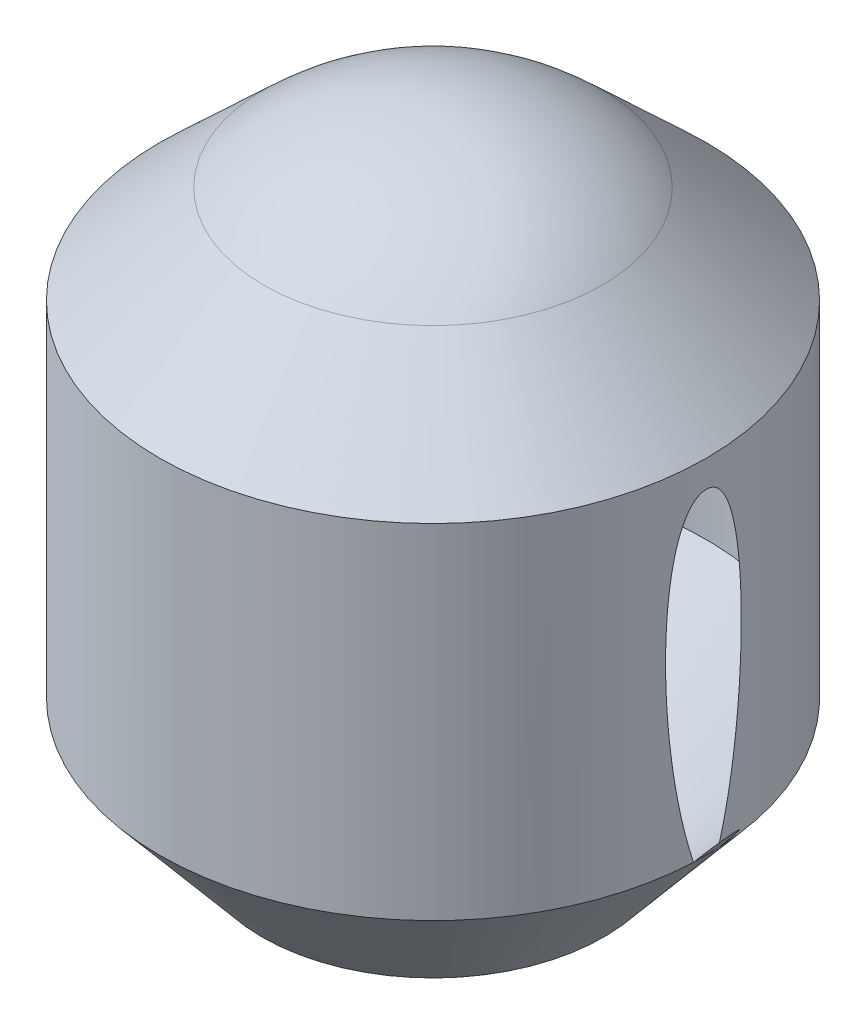
ISO-10303-21;
HEADER;
FILE_DESCRIPTION(('STEP AP214'),'2;1');
FILE_NAME('part.step','',(''),(''),'','','');
FILE_SCHEMA(('AUTOMOTIVE_DESIGN { 1 0 10303 214 1 1 1 1 }'));
ENDSEC;
DATA;
#1=APPLICATION_CONTEXT('core data for automotive mechanical design processes');
#2=APPLICATION_PROTOCOL_DEFINITION('international standard','automotive_design',2000,#1);
#3=PRODUCT_CONTEXT('',#1,'mechanical');
#4=PRODUCT('Part','Part','',(#3));
#5=PRODUCT_RELATED_PRODUCT_CATEGORY('part','',(#4));
#6=PRODUCT_DEFINITION_FORMATION('','',#4);
#7=PRODUCT_DEFINITION_CONTEXT('part definition',#1,'design');
#8=PRODUCT_DEFINITION('design','',#6,#7);
#9=PRODUCT_DEFINITION_SHAPE('','',#8);
#10=(LENGTH_UNIT() NAMED_UNIT(*) SI_UNIT(.MILLI.,.METRE.));
#11=(NAMED_UNIT(*) PLANE_ANGLE_UNIT() SI_UNIT($,.RADIAN.));
#12=(NAMED_UNIT(*) SI_UNIT($,.STERADIAN.) SOLID_ANGLE_UNIT());
#13=UNCERTAINTY_MEASURE_WITH_UNIT(LENGTH_MEASURE(1.E-05),#10,'distance_accuracy_value','');
#14=(GEOMETRIC_REPRESENTATION_CONTEXT(3) GLOBAL_UNCERTAINTY_ASSIGNED_CONTEXT((#13)) GLOBAL_UNIT_ASSIGNED_CONTEXT((#10,
#11,#12)) REPRESENTATION_CONTEXT('',''));
#15=CARTESIAN_POINT('',(0.,0.,0.));
#16=DIRECTION('',(0.,0.,1.));
#17=DIRECTION('',(1.,0.,0.));
#18=AXIS2_PLACEMENT_3D('',#15,#16,#17);
#19=CARTESIAN_POINT('',(0.,0.,0.));
#20=DIRECTION('',(0.,1.,0.));
#21=DIRECTION('',(0.,0.,1.));
#22=AXIS2_PLACEMENT_3D('',#19,#20,#21);
#23=CYLINDRICAL_SURFACE('',#22,40.);
#24=CARTESIAN_POINT('',(0.,68.1923714759536,0.));
#25=DIRECTION('',(0.,1.,0.));
#26=DIRECTION('',(0.,0.,1.));
#27=AXIS2_PLACEMENT_3D('',#24,#25,#26);
#28=CIRCLE('',#27,40.);
#29=CARTESIAN_POINT('',(0.,68.1923714759536,40.));
#30=VERTEX_POINT('',#29);
#31=EDGE_CURVE('E150',#30,#30,#28,.T.);
#32=ORIENTED_EDGE('',*,*,#31,.F.);
#33=EDGE_LOOP('',(#32));
#34=FACE_BOUND('',#33,.T.);
#35=CARTESIAN_POINT('',(39.9611398564331,17.8763038889132,-1.76275391776369));
#36=CARTESIAN_POINT('',(39.9590485028743,18.0263892158643,-1.81015966207606));
#37=CARTESIAN_POINT('',(39.9569044252968,18.1766969010565,-1.85685430112768));
#38=CARTESIAN_POINT('',(39.9525211074002,18.4777203207342,-1.94889280478911));
#39=CARTESIAN_POINT('',(39.9502818692163,18.6284360459937,-1.99423669966641));
#40=CARTESIAN_POINT('',(39.9434345761404,19.0812906239706,-2.12839409840408));
#41=CARTESIAN_POINT('',(39.9386989050502,19.3839973541604,-2.21528939992617));
#42=CARTESIAN_POINT('',(39.9289599666741,19.9907157059756,-2.38439171398567));
#43=CARTESIAN_POINT('',(39.9239566938508,20.2947273544834,-2.4665986294352));
#44=CARTESIAN_POINT('',(39.9137456904261,20.9039364060846,-2.62665946344014));
#45=CARTESIAN_POINT('',(39.9085379311249,21.2091339701673,-2.70451276721676));
#46=CARTESIAN_POINT('',(39.8979746236317,21.8205442648095,-2.85611254358982));
#47=CARTESIAN_POINT('',(39.8926190739814,22.1267570053605,-2.92985897563807));
#48=CARTESIAN_POINT('',(39.8727624790475,23.2537486178319,-3.19375435858761));
#49=CARTESIAN_POINT('',(39.8579678566055,24.0773387924444,-3.37198065621902));
#50=CARTESIAN_POINT('',(39.8284955807113,25.729601005784,-3.70386168263656));
#51=CARTESIAN_POINT('',(39.813817955251,26.5582741814088,-3.85751068950451));
#52=CARTESIAN_POINT('',(39.7851956016083,28.2195694336083,-4.14230435668526));
#53=CARTESIAN_POINT('',(39.7712509483228,29.0521919042914,-4.27344672030212));
#54=CARTESIAN_POINT('',(39.7445765560971,30.7213895406754,-4.51479407356579));
#55=CARTESIAN_POINT('',(39.7318481465492,31.55796800588,-4.62497628050368));
#56=CARTESIAN_POINT('',(39.7080356832509,33.2334613142061,-4.8251484334156));
#57=CARTESIAN_POINT('',(39.6969514320749,34.0723758644728,-4.91514080439155));
#58=CARTESIAN_POINT('',(39.6818213389432,35.3321275230994,-5.03534175179843));
#59=CARTESIAN_POINT('',(39.6770274740735,35.752262347261,-5.0729432449608));
#60=CARTESIAN_POINT('',(39.6679775212901,36.5929641788985,-5.14322933997175));
#61=CARTESIAN_POINT('',(39.6637214567729,37.013531204375,-5.17591372791944));
#62=CARTESIAN_POINT('',(39.649234739176,38.5498630563852,-5.2862881746443));
#63=CARTESIAN_POINT('',(39.6407441171493,39.666769183475,-5.34916893712544));
#64=CARTESIAN_POINT('',(39.6315577090053,41.3431640633532,-5.41664825008471));
#65=CARTESIAN_POINT('',(39.629087149183,41.9021440249106,-5.43466779034163));
#66=CARTESIAN_POINT('',(39.6254094833573,43.020327625321,-5.46142157805313));
#67=CARTESIAN_POINT('',(39.6242023489269,43.579531258858,-5.47015603442257));
#68=CARTESIAN_POINT('',(39.6231335969856,44.6975354826311,-5.47789153040553));
#69=CARTESIAN_POINT('',(39.6232708432422,45.2563360140999,-5.47690078947819));
#70=CARTESIAN_POINT('',(39.6249699154677,46.3738129938668,-5.46459529877964));
#71=CARTESIAN_POINT('',(39.6265317077088,46.9324894447896,-5.45328079343536));
#72=CARTESIAN_POINT('',(39.631163729074,48.0494038447402,-5.41951618106935));
#73=CARTESIAN_POINT('',(39.6342336836384,48.6076418550655,-5.39706810089933));
#74=CARTESIAN_POINT('',(39.6419705174818,49.723473150519,-5.33994486648881));
#75=CARTESIAN_POINT('',(39.6466373468622,50.2810664552465,-5.30527009430371));
#76=CARTESIAN_POINT('',(39.65797312173,51.4266481178843,-5.21987908494987));
#77=CARTESIAN_POINT('',(39.664740142785,52.0145770479995,-5.16836839821881));
#78=CARTESIAN_POINT('',(39.6802822241238,53.1887142903217,-5.0476692685949));
#79=CARTESIAN_POINT('',(39.6890575365492,53.7749223771085,-4.97847860584953));
#80=CARTESIAN_POINT('',(39.7038261483287,54.6523248503745,-4.85878265328046));
#81=CARTESIAN_POINT('',(39.7090196795723,54.944622381182,-4.81620661006086));
#82=CARTESIAN_POINT('',(39.7199579474636,55.5282825126726,-4.72515142357244));
#83=CARTESIAN_POINT('',(39.7257026644103,55.8196451463874,-4.67667249127454));
#84=CARTESIAN_POINT('',(39.7377580320454,56.4011060163797,-4.57310664893302));
#85=CARTESIAN_POINT('',(39.7440685286189,56.6912045745429,-4.51802153700129));
#86=CARTESIAN_POINT('',(39.7572717553994,57.2698480751796,-4.40032433227798));
#87=CARTESIAN_POINT('',(39.7641644483086,57.5583931159197,-4.33771272155516));
#88=CARTESIAN_POINT('',(39.7790607687877,58.1540703294145,-4.19899312521838));
#89=CARTESIAN_POINT('',(39.7871086145867,58.4610520461732,-4.12223937353388));
#90=CARTESIAN_POINT('',(39.8039003352788,59.0719072228386,-3.95682581762682));
#91=CARTESIAN_POINT('',(39.8126443858193,59.3757798763905,-3.8681630049361));
#92=CARTESIAN_POINT('',(39.8262609141268,59.8276534807929,-3.72440906453517));
#93=CARTESIAN_POINT('',(39.8308760355206,59.9774054613559,-3.67477839320006));
#94=CARTESIAN_POINT('',(39.8402726222944,60.2754964786168,-3.57146694798127));
#95=CARTESIAN_POINT('',(39.8450540761734,60.4238356121056,-3.51778645382234));
#96=CARTESIAN_POINT('',(39.8547744593475,60.7187112702105,-3.40589258336312));
#97=CARTESIAN_POINT('',(39.8597133100915,60.8652486449407,-3.34768144784958));
#98=CARTESIAN_POINT('',(39.8697388382182,61.1561463783901,-3.22608916944573));
#99=CARTESIAN_POINT('',(39.8748254936026,61.3005070562655,-3.16270879339932));
#100=CARTESIAN_POINT('',(39.8838868344422,61.5520141766946,-3.04600025336093));
#101=CARTESIAN_POINT('',(39.8878340843065,61.6597450647283,-2.99393043128845));
#102=CARTESIAN_POINT('',(39.8957909843118,61.8732785495515,-2.88596505333951));
#103=CARTESIAN_POINT('',(39.8998006343561,61.9790811493298,-2.83006950339317));
#104=CARTESIAN_POINT('',(39.9078737717702,62.1885427731248,-2.7138556320509));
#105=CARTESIAN_POINT('',(39.9119373582667,62.2921965626053,-2.65352784055197));
#106=CARTESIAN_POINT('',(39.9200844734736,62.496525432667,-2.52800574096931));
#107=CARTESIAN_POINT('',(39.924168001605,62.5972005991427,-2.46281157340858));
#108=CARTESIAN_POINT('',(39.9323640793071,62.795874174006,-2.3261637473852));
#109=CARTESIAN_POINT('',(39.9364764534756,62.8938309136507,-2.25464908090042));
#110=CARTESIAN_POINT('',(39.944632592585,63.0848192145597,-2.10521531767769));
#111=CARTESIAN_POINT('',(39.948676336949,63.1778493158242,-2.02729433971111));
#112=CARTESIAN_POINT('',(39.9566051935094,63.3571881096163,-1.86448977638103));
#113=CARTESIAN_POINT('',(39.9604907351211,63.4435156669234,-1.7796272240149));
#114=CARTESIAN_POINT('',(39.9680018629767,63.6076372505638,-1.60209881281971));
#115=CARTESIAN_POINT('',(39.9716276904397,63.6854392318886,-1.50944037335939));
#116=CARTESIAN_POINT('',(39.978817877199,63.8372391585443,-1.30593562381109));
#117=CARTESIAN_POINT('',(39.9823397804493,63.9100774261688,-1.1941971337078));
#118=CARTESIAN_POINT('',(39.9870508599528,64.0058735488369,-1.01939011138929));
#119=CARTESIAN_POINT('',(39.988525067038,64.0355454986102,-0.959966627623872));
#120=CARTESIAN_POINT('',(39.9912484650441,64.0898652504649,-0.838873487897658));
#121=CARTESIAN_POINT('',(39.9924977695672,64.1145155898805,-0.777204984967213));
#122=CARTESIAN_POINT('',(39.994728612455,64.1580901207646,-0.652345956399909));
#123=CARTESIAN_POINT('',(39.9957119456752,64.1770527941324,-0.589168932732252));
#124=CARTESIAN_POINT('',(39.9973904284358,64.2089775797693,-0.461341693332102));
#125=CARTESIAN_POINT('',(39.9980857971449,64.2219442564473,-0.396692637641672));
#126=CARTESIAN_POINT('',(39.9988945874061,64.2366431630949,-0.29914481099312));
#127=CARTESIAN_POINT('',(39.9991249467268,64.2407479832947,-0.266588934935891));
#128=CARTESIAN_POINT('',(39.9995066582936,64.2473939956722,-0.201322728437519));
#129=CARTESIAN_POINT('',(39.999658027886,64.2499355311694,-0.168612433500169));
#130=CARTESIAN_POINT('',(39.999880477236,64.2535191898735,-0.103120831901769));
#131=CARTESIAN_POINT('',(39.9999515804449,64.2545617510565,-0.0703395487870745));
#132=CARTESIAN_POINT('',(40.0000131727782,64.2552708538528,-0.00475694666644795));
#133=CARTESIAN_POINT('',(40.0000036398037,64.2549370182661,0.0280443753683693));
#134=CARTESIAN_POINT('',(39.9998547351261,64.2519943173948,0.125891562360668));
#135=CARTESIAN_POINT('',(39.9995967872351,64.2474694022495,0.190892816502696));
#136=CARTESIAN_POINT('',(39.9987698879117,64.2329766282829,0.320310970312462));
#137=CARTESIAN_POINT('',(39.9982008003239,64.2230063865785,0.38472760159328));
#138=CARTESIAN_POINT('',(39.996759188533,64.1974859941992,0.513257331036863));
#139=CARTESIAN_POINT('',(39.9958830697428,64.1818696698085,0.577357284514759));
#140=CARTESIAN_POINT('',(39.9938540396024,64.1453264941875,0.7040314870253));
#141=CARTESIAN_POINT('',(39.9927010234778,64.124397632586,0.766605148630973));
#142=CARTESIAN_POINT('',(39.9888681715465,64.0540910219518,0.951640895350901));
#143=CARTESIAN_POINT('',(39.9858160485269,63.9972193447247,1.07129087679902));
#144=CARTESIAN_POINT('',(39.9776001368313,63.8405200553706,1.34828636418797));
#145=CARTESIAN_POINT('',(39.9720833002205,63.7326375837123,1.501024624685));
#146=CARTESIAN_POINT('',(39.9632451419999,63.5541402645951,1.71586420787919));
#147=CARTESIAN_POINT('',(39.9602003726455,63.4917580359595,1.78519093373596));
#148=CARTESIAN_POINT('',(39.953979083009,63.3623673200438,1.91939027487303));
#149=CARTESIAN_POINT('',(39.9508025766834,63.2953593223303,1.98426336005789));
#150=CARTESIAN_POINT('',(39.9418079311404,63.1027581318104,2.15980826003992));
#151=CARTESIAN_POINT('',(39.9358985007661,62.9729638425003,2.26586066961793));
#152=CARTESIAN_POINT('',(39.9240076718826,62.7047897529884,2.4665156959506));
#153=CARTESIAN_POINT('',(39.9180262142904,62.5664024535875,2.56110809284288));
#154=CARTESIAN_POINT('',(39.9060942635817,62.2831342520514,2.74075855455309));
#155=CARTESIAN_POINT('',(39.9001438856668,62.1382379421351,2.82579212557894));
#156=CARTESIAN_POINT('',(39.8883617206514,61.8439629310819,2.98750066921677));
#157=CARTESIAN_POINT('',(39.8825298894027,61.6945859518758,3.06417880166205));
#158=CARTESIAN_POINT('',(39.8707178871601,61.3843668070843,3.21431497474864));
#159=CARTESIAN_POINT('',(39.8647463322852,61.223337487966,3.28738463328894));
#160=CARTESIAN_POINT('',(39.8530058649686,60.8983612054858,3.42677835362451));
#161=CARTESIAN_POINT('',(39.8472369918158,60.7344136856248,3.49310111224047));
#162=CARTESIAN_POINT('',(39.8359094930091,60.4039980993901,3.61999710781998));
#163=CARTESIAN_POINT('',(39.8303512337212,60.2375262881259,3.68056057986446));
#164=CARTESIAN_POINT('',(39.8194629219439,59.9027871652595,3.79654480719154));
#165=CARTESIAN_POINT('',(39.8141328905325,59.7345196896024,3.85196508802015));
#166=CARTESIAN_POINT('',(39.7984830662778,59.227310030221,4.01151518213124));
#167=CARTESIAN_POINT('',(39.788512076382,58.8862102372251,4.10884075572986));
#168=CARTESIAN_POINT('',(39.7694512778409,58.1985629619095,4.28940111341274));
#169=CARTESIAN_POINT('',(39.760366028479,57.851996971222,4.37256448369381));
#170=CARTESIAN_POINT('',(39.743115043544,57.1565898790213,4.52667691415877));
#171=CARTESIAN_POINT('',(39.7349482263389,56.8077519766159,4.59764039530172));
#172=CARTESIAN_POINT('',(39.7194907719582,56.1082501593645,4.72931642207628));
#173=CARTESIAN_POINT('',(39.7121998824328,55.757586800943,4.79003192214408));
#174=CARTESIAN_POINT('',(39.6988066607731,55.0727578276824,4.89975904713836));
#175=CARTESIAN_POINT('',(39.6926626783855,54.73866279202,4.94920961684712));
#176=CARTESIAN_POINT('',(39.6810995944825,54.0694873554842,5.04107879991056));
#177=CARTESIAN_POINT('',(39.6756805209863,53.7344069170344,5.08349714147143));
#178=CARTESIAN_POINT('',(39.6655359554173,53.0633024143655,5.16205643286852));
#179=CARTESIAN_POINT('',(39.6608108772942,52.7272779078219,5.19819363851365));
#180=CARTESIAN_POINT('',(39.6520310309145,52.0546512044453,5.26474612260582));
#181=CARTESIAN_POINT('',(39.6479762786239,51.7180489940453,5.2951612647656));
#182=CARTESIAN_POINT('',(39.6367776604379,50.7074840476402,5.37857483355207));
#183=CARTESIAN_POINT('',(39.6306008028989,50.0328546267206,5.42373096791815));
#184=CARTESIAN_POINT('',(39.620655989455,48.6850687340217,5.49589801752047));
#185=CARTESIAN_POINT('',(39.6168794866954,48.0119156384608,5.52297333012066));
#186=CARTESIAN_POINT('',(39.6115348091399,46.6653370799914,5.56117608103771));
#187=CARTESIAN_POINT('',(39.6099660434153,45.9919117382446,5.5723077868758));
#188=CARTESIAN_POINT('',(39.6088829483534,44.6448974573078,5.57999979572721));
#189=CARTESIAN_POINT('',(39.6093688899214,43.9713085082546,5.57655817730357));
#190=CARTESIAN_POINT('',(39.6123440329428,42.5820345623873,5.55538694918834));
#191=CARTESIAN_POINT('',(39.6149571687642,41.8663634706266,5.53677329779943));
#192=CARTESIAN_POINT('',(39.6221801962518,40.4353914046075,5.48484465040249));
#193=CARTESIAN_POINT('',(39.6267905844925,39.7200905667147,5.45152599826931));
#194=CARTESIAN_POINT('',(39.6378446839769,38.2902104423788,5.37056232871088));
#195=CARTESIAN_POINT('',(39.6442886637918,37.5756312770397,5.32291521249757));
#196=CARTESIAN_POINT('',(39.6588403854297,36.1475700422772,5.2133897851085));
#197=CARTESIAN_POINT('',(39.666948153218,35.4340879901506,5.15151125183185));
#198=CARTESIAN_POINT('',(39.6846402326946,34.008613300884,5.01339999381933));
#199=CARTESIAN_POINT('',(39.6942243759766,33.2966205032459,4.93716890601969));
#200=CARTESIAN_POINT('',(39.7146588033827,31.8745329383339,4.77000741897711));
#201=CARTESIAN_POINT('',(39.7255088139476,31.1644377947732,4.67908019400027));
#202=CARTESIAN_POINT('',(39.7482399977529,29.7462271714193,4.48188317336848));
#203=CARTESIAN_POINT('',(39.7601214056817,29.0381121802335,4.37560988213937));
#204=CARTESIAN_POINT('',(39.7846282350562,27.6245878594439,4.14687828676006));
#205=CARTESIAN_POINT('',(39.7972535708489,26.9191782282775,4.0244218438662));
#206=CARTESIAN_POINT('',(39.8229089151284,25.511665603535,3.76208736793014));
#207=CARTESIAN_POINT('',(39.8359388897301,24.8095623387196,3.62221079073631));
#208=CARTESIAN_POINT('',(39.8619904471596,23.4093410294114,3.32329562888232));
#209=CARTESIAN_POINT('',(39.8750120290823,22.7112233661963,3.1642552420766));
#210=CARTESIAN_POINT('',(39.8941356880392,21.6678028194749,2.90949248021069));
#211=CARTESIAN_POINT('',(39.9004438888275,21.3205219799435,2.82184347680257));
#212=CARTESIAN_POINT('',(39.9128388262632,20.6274757652572,2.64074768859963));
#213=CARTESIAN_POINT('',(39.9189255682259,20.2817103539056,2.54730104310132));
#214=CARTESIAN_POINT('',(39.9307926838133,19.5914245131456,2.35397380151019));
#215=CARTESIAN_POINT('',(39.9365725953986,19.2469066507445,2.25408397745954));
#216=CARTESIAN_POINT('',(39.9449224209539,18.7316889028805,2.09901148798855));
#217=CARTESIAN_POINT('',(39.9476524693796,18.5602019525789,2.04644526112799));
#218=CARTESIAN_POINT('',(39.9529898239807,18.2178053737435,1.93945000975557));
#219=CARTESIAN_POINT('',(39.9555971281212,18.0468957548242,1.88502095438833));
#220=CARTESIAN_POINT('',(39.9581350340868,17.8763038889132,1.82960230588169));
#221=B_SPLINE_CURVE_WITH_KNOTS('',3,(#35,#36,#37,#38,#39,#40,#41,#42,#43,#44,#45,#46,#47,#48,
#49,#50,#51,#52,#53,#54,#55,#56,#57,#58,#59,#60,#61,#62,#63,#64,#65,#66,#67,#68,#69,#70,#71,#72,
#73,#74,#75,#76,#77,#78,#79,#80,#81,#82,#83,#84,#85,#86,#87,#88,#89,#90,#91,#92,#93,#94,#95,#96,
#97,#98,#99,#100,#101,#102,#103,#104,#105,#106,#107,#108,#109,#110,#111,#112,#113,#114,#115,
#116,#117,#118,#119,#120,#121,#122,#123,#124,#125,#126,#127,#128,#129,#130,#131,#132,#133,#134,
#135,#136,#137,#138,#139,#140,#141,#142,#143,#144,#145,#146,#147,#148,#149,#150,#151,#152,#153,
#154,#155,#156,#157,#158,#159,#160,#161,#162,#163,#164,#165,#166,#167,#168,#169,#170,#171,#172,
#173,#174,#175,#176,#177,#178,#179,#180,#181,#182,#183,#184,#185,#186,#187,#188,#189,#190,#191,
#192,#193,#194,#195,#196,#197,#198,#199,#200,#201,#202,#203,#204,#205,#206,#207,#208,#209,#210,
#211,#212,#213,#214,#215,#216,#217,#218,#219,#220),.UNSPECIFIED.,.F.,.F.,(4,2,2,2,2,2,2,2,2,2,2,
2,2,2,2,2,2,2,2,2,2,2,2,2,2,2,2,2,2,2,2,2,2,2,2,2,2,2,2,2,2,2,2,2,2,2,2,2,2,2,2,2,2,2,2,2,2,2,2,
2,2,2,2,2,2,2,2,2,2,2,2,2,2,2,2,2,2,2,2,2,2,2,2,2,2,2,2,2,2,2,2,2,4),(0.,0.472219816183271,
0.944429042882675,1.88928629465752,2.83416310559544,3.77917300854017,4.72419224015099,
7.2520610977721,9.78051762278689,12.3092320115497,14.8406794829635,17.3718227391559,
18.6373199862265,19.9028722682712,23.2583042866268,24.9360745936229,26.6138071499011,
28.2901218566848,29.9663968758301,31.6423668434071,33.3182844455002,35.0887251820473,
36.8593883199214,37.7456226784973,38.6318253721002,39.5177873985649,40.4036927097752,
41.3531086862979,42.3027649570489,42.7762070463199,43.249616464425,43.7227932113554,
44.195899890934,44.5549941067921,44.914087766043,45.2739723375512,45.6338465209372,
45.9976824618404,46.3616256282809,46.7245042262229,47.0870412955625,47.4858555483654,
47.6849759220908,47.8839954327565,48.0816363471771,48.2791265601995,48.377537969212,
48.4759277579645,48.5742887929681,48.6726767855055,48.8679186346272,49.0632459904111,
49.260941072026,49.4587110772646,49.8546348454929,50.4125542228397,50.6923389442583,
50.9720941000188,51.4743910354852,51.9771326648553,52.481134501915,52.9849450707786,
53.5155608280216,54.0462788810991,54.5778813000959,55.1095327102109,56.1736344589445,
57.2429525800091,58.3109978834575,59.3787347474771,60.3920231989328,61.4053508046005,
62.419280399518,63.4332341410033,65.4614181914069,67.4823394971893,69.5027197749952,
71.5233664404927,73.6709577020715,75.8190832233772,77.9675235486989,80.1159974056704,
82.2642263733718,84.4119919567313,86.5602475387206,88.7082562602571,90.8560855871331,
93.0041170516016,94.0787551079083,95.1533673545141,96.2295543926272,96.7676954646986,
97.3058454547056),.UNSPECIFIED.);
#222=CARTESIAN_POINT('',(39.9607433854604,17.8765255869172,-1.76969908218324));
#223=VERTEX_POINT('',#222);
#224=CARTESIAN_POINT('',(39.9581110745676,17.8763293961351,1.83012199894084));
#225=VERTEX_POINT('',#224);
#226=EDGE_CURVE('E14',#223,#225,#221,.T.);
#227=ORIENTED_EDGE('',*,*,#226,.F.);
#228=CARTESIAN_POINT('',(0.,17.8763038889132,0.));
#229=DIRECTION('',(0.,1.,0.));
#230=DIRECTION('',(0.,0.,1.));
#231=AXIS2_PLACEMENT_3D('',#228,#229,#230);
#232=CIRCLE('',#231,40.);
#233=EDGE_CURVE('E144',#223,#225,#232,.T.);
#234=ORIENTED_EDGE('',*,*,#233,.T.);
#235=EDGE_LOOP('',(#227,#234));
#236=FACE_BOUND('',#235,.T.);
#237=ADVANCED_FACE('F104',(#34,#236),#23,.T.);
#238=CARTESIAN_POINT('',(0.,0.,0.));
#239=DIRECTION('',(0.,1.,0.));
#240=DIRECTION('',(0.,0.,1.));
#241=AXIS2_PLACEMENT_3D('',#238,#239,#240);
#242=PLANE('',#241);
#243=CARTESIAN_POINT('',(0.,0.,0.));
#244=DIRECTION('',(0.,1.,0.));
#245=DIRECTION('',(0.,0.,1.));
#246=AXIS2_PLACEMENT_3D('',#243,#244,#245);
#247=CIRCLE('',#246,25.);
#248=CARTESIAN_POINT('',(0.,0.,25.));
#249=VERTEX_POINT('',#248);
#250=EDGE_CURVE('E132',#249,#249,#247,.T.);
#251=ORIENTED_EDGE('',*,*,#250,.F.);
#252=EDGE_LOOP('',(#251));
#253=FACE_BOUND('',#252,.T.);
#254=ADVANCED_FACE('F106',(#253),#242,.F.);
#255=CARTESIAN_POINT('',(0.,0.,0.));
#256=DIRECTION('',(0.,1.,0.));
#257=DIRECTION('',(0.,0.,1.));
#258=AXIS2_PLACEMENT_3D('',#255,#256,#257);
#259=CONICAL_SURFACE('',#258,25.,0.698131700797729);
#260=EDGE_CURVE('E149',#225,#223,#232,.T.);
#261=ORIENTED_EDGE('',*,*,#260,.F.);
#262=ORIENTED_EDGE('',*,*,#233,.F.);
#263=EDGE_LOOP('',(#261,#262));
#264=FACE_BOUND('',#263,.T.);
#265=ORIENTED_EDGE('',*,*,#250,.T.);
#266=EDGE_LOOP('',(#265));
#267=FACE_BOUND('',#266,.T.);
#268=ADVANCED_FACE('F147',(#264,#267),#259,.T.);
#269=ORIENTED_EDGE('',*,*,#260,.T.);
#270=CARTESIAN_POINT('',(39.9611735561339,17.876995532392,-1.76198978900118));
#271=CARTESIAN_POINT('',(39.9619954583982,17.8776722728191,-1.74334942332088));
#272=CARTESIAN_POINT('',(39.9628043648554,17.8783163736236,-1.72470737279887));
#273=CARTESIAN_POINT('',(39.9643961337995,17.8795715006856,-1.68742106086768));
#274=CARTESIAN_POINT('',(39.9651789963196,17.8801825269851,-1.66877679946136));
#275=CARTESIAN_POINT('',(39.9667186374135,17.8814037194536,-1.63148692794326));
#276=CARTESIAN_POINT('',(39.9674754156386,17.8820138856109,-1.6128413178168));
#277=CARTESIAN_POINT('',(39.9689628497434,17.8832549437758,-1.57554972544889));
#278=CARTESIAN_POINT('',(39.9696935055955,17.8838858358054,-1.55690374320706));
#279=CARTESIAN_POINT('',(39.9718463570474,17.8857837683638,-1.50096359218817));
#280=CARTESIAN_POINT('',(39.9732294008486,17.8870560363513,-1.46366808363207));
#281=CARTESIAN_POINT('',(39.9758911900933,17.8895093893911,-1.38907037879982));
#282=CARTESIAN_POINT('',(39.9771699357314,17.8906904746137,-1.3517681825363));
#283=CARTESIAN_POINT('',(39.9808496809212,17.8940436874863,-1.23985139596808));
#284=CARTESIAN_POINT('',(39.9830942167498,17.8960257990922,-1.16522588031729));
#285=CARTESIAN_POINT('',(39.9871655450438,17.8995996867173,-1.01595582492934));
#286=CARTESIAN_POINT('',(39.9889923460167,17.9011914706859,-0.941311285610606));
#287=CARTESIAN_POINT('',(39.9922280408758,17.9039398315579,-0.792005022318129));
#288=CARTESIAN_POINT('',(39.9936369346728,17.9050964083684,-0.717343298340721));
#289=CARTESIAN_POINT('',(39.9960366007769,17.9069915447102,-0.568007895758537));
#290=CARTESIAN_POINT('',(39.9970273731458,17.9077301043032,-0.493334217155527));
#291=CARTESIAN_POINT('',(39.9985906664438,17.9087987205813,-0.343979621309493));
#292=CARTESIAN_POINT('',(39.9991631876114,17.9091287774993,-0.269298704070619));
#293=CARTESIAN_POINT('',(39.9998899159015,17.9094601790272,-0.119934569619009));
#294=CARTESIAN_POINT('',(40.0000441238471,17.9094615242838,-0.0452513524110891));
#295=CARTESIAN_POINT('',(39.9999342205086,17.9094310325451,0.104114775840563));
#296=CARTESIAN_POINT('',(39.9996701096821,17.9093991955859,0.178797686884541));
#297=CARTESIAN_POINT('',(39.9987235857198,17.9089396896707,0.328160058394369));
#298=CARTESIAN_POINT('',(39.9980411715515,17.9085120197376,0.402839518851246));
#299=CARTESIAN_POINT('',(39.9962581096786,17.907303088882,0.552190588007907));
#300=CARTESIAN_POINT('',(39.9951574616723,17.9065218277046,0.626862196701988));
#301=CARTESIAN_POINT('',(39.9925380740423,17.9045426544488,0.776192643931078));
#302=CARTESIAN_POINT('',(39.9910193343761,17.9033447423281,0.85085148246479));
#303=CARTESIAN_POINT('',(39.9875639585761,17.9005605194009,1.00015215132665));
#304=CARTESIAN_POINT('',(39.9856273224841,17.8989742086332,1.0747939816565));
#305=CARTESIAN_POINT('',(39.9802254526334,17.8944918156669,1.26270137868637));
#306=CARTESIAN_POINT('',(39.976487960998,17.891342854114,1.37595315905246));
#307=CARTESIAN_POINT('',(39.968051201643,17.8843223942235,1.60241184095038));
#308=CARTESIAN_POINT('',(39.9633518223738,17.8804508120885,1.71561873574984));
#309=CARTESIAN_POINT('',(39.9581721296683,17.8763038889132,1.82879196624163));
#310=B_SPLINE_CURVE_WITH_KNOTS('',3,(#270,#271,#272,#273,#274,#275,#276,#277,#278,#279,#280,
#281,#282,#283,#284,#285,#286,#287,#288,#289,#290,#291,#292,#293,#294,#295,#296,#297,#298,#299,
#300,#301,#302,#303,#304,#305,#306,#307,#308,#309),.UNSPECIFIED.,.F.,.F.,(4,2,2,2,2,2,2,2,2,2,2,
2,2,2,2,2,2,2,2,4),(0.,0.0560121065112632,0.112024141651377,0.16803692514418,0.224049768096375,
0.33607805120302,0.448106125215835,0.672160087526338,0.896209486333984,1.12025893292837,
1.34430834644281,1.56835763224676,1.79240647721185,2.01645507714039,2.24050423013813,
2.4645535447212,2.68860288203324,2.91265219687446,3.25271671095415,3.59282068447979),.UNSPECIFIED.);
#311=EDGE_CURVE('E119',#223,#225,#310,.T.);
#312=ORIENTED_EDGE('',*,*,#311,.T.);
#313=EDGE_LOOP('',(#269,#312));
#314=FACE_BOUND('',#313,.T.);
#315=ADVANCED_FACE('F152',(#314),#23,.T.);
#316=CARTESIAN_POINT('',(0.,68.1923714759536,0.));
#317=DIRECTION('',(0.,-1.,0.));
#318=DIRECTION('',(0.,0.,-1.));
#319=AXIS2_PLACEMENT_3D('',#316,#317,#318);
#320=CONICAL_SURFACE('',#319,40.,0.817020855595799);
#321=CARTESIAN_POINT('',(0.,82.4953704156234,0.));
#322=DIRECTION('',(0.,1.,0.));
#323=DIRECTION('',(0.,0.,1.));
#324=AXIS2_PLACEMENT_3D('',#321,#322,#323);
#325=CIRCLE('',#324,24.7625407373199);
#326=CARTESIAN_POINT('',(0.,82.4953704156234,24.7625407373199));
#327=VERTEX_POINT('',#326);
#328=EDGE_CURVE('E139',#327,#327,#325,.T.);
#329=ORIENTED_EDGE('',*,*,#328,.F.);
#330=EDGE_LOOP('',(#329));
#331=FACE_BOUND('',#330,.T.);
#332=ORIENTED_EDGE('',*,*,#31,.T.);
#333=EDGE_LOOP('',(#332));
#334=FACE_BOUND('',#333,.T.);
#335=ADVANCED_FACE('F207',(#331,#334),#320,.T.);
#336=CARTESIAN_POINT('',(0.,56.1150142877302,0.));
#337=DIRECTION('',(0.,1.,0.));
#338=DIRECTION('',(1.,0.,0.));
#339=AXIS2_PLACEMENT_3D('',#336,#337,#338);
#340=SPHERICAL_SURFACE('',#339,36.1815783680301);
#341=ORIENTED_EDGE('',*,*,#328,.T.);
#342=EDGE_LOOP('',(#341));
#343=FACE_BOUND('',#342,.T.);
#344=ADVANCED_FACE('F199',(#343),#340,.T.);
#345=CARTESIAN_POINT('',(39.,64.6181854819055,0.));
#346=CARTESIAN_POINT('',(39.,64.6181854819055,0.));
#347=CARTESIAN_POINT('',(39.,64.6181854819055,0.));
#348=CARTESIAN_POINT('',(39.,64.6181854819055,0.));
#349=CARTESIAN_POINT('',(39.,64.6181854819055,0.));
#350=CARTESIAN_POINT('',(39.,64.6181854819055,-3.69382576257727));
#351=CARTESIAN_POINT('',(40.2531912353326,64.6181854819055,-3.69382576257727));
#352=CARTESIAN_POINT('',(52.945650313426,59.9158180956025,-0.155364277830774));
#353=CARTESIAN_POINT('',(40.1505447846806,64.6219672799652,4.00455431823882));
#354=CARTESIAN_POINT('',(39.,64.6181854819055,3.69382576257727));
#355=CARTESIAN_POINT('',(39.,53.5539488387447,-6.00246686418806));
#356=CARTESIAN_POINT('',(41.0040466314318,53.5539488387447,-6.00246686418806));
#357=CARTESIAN_POINT('',(58.626632607415,47.3477208477764,-0.250795447339822));
#358=CARTESIAN_POINT('',(40.8611820649622,53.5557280627964,6.50405775886771));
#359=CARTESIAN_POINT('',(39.,53.5539488387447,6.00246686418806));
#360=CARTESIAN_POINT('',(39.,36.3278485160242,-5.30987453370483));
#361=CARTESIAN_POINT('',(40.6197784687804,36.3278485160242,-5.30987453370483));
#362=CARTESIAN_POINT('',(54.7474507553266,31.6644068732626,-0.210247605051018));
#363=CARTESIAN_POINT('',(40.5735712725339,36.2963760479787,5.73036974380686));
#364=CARTESIAN_POINT('',(39.,36.3278485160242,5.30987453370482));
#365=CARTESIAN_POINT('',(39.,29.0191097653116,-4.44413412060078));
#366=CARTESIAN_POINT('',(40.3072951272181,29.0191097653116,-4.44413412060078));
#367=CARTESIAN_POINT('',(51.6049485585785,25.4224935770822,-0.167220797354467));
#368=CARTESIAN_POINT('',(40.2616266884814,28.9677762470563,4.77857571530971));
#369=CARTESIAN_POINT('',(39.,29.0191097653116,4.44413412060077));
#370=CARTESIAN_POINT('',(39.,23.4095840603395,-3.40524562487592));
#371=CARTESIAN_POINT('',(39.9726516466253,23.4095840603395,-3.40524562487592));
#372=CARTESIAN_POINT('',(48.3222643328487,20.8311444577795,-0.123161208803217));
#373=CARTESIAN_POINT('',(39.9397344495883,23.3569176318639,3.65156804248235));
#374=CARTESIAN_POINT('',(39.,23.4095840603395,3.40524562487592));
#375=CARTESIAN_POINT('',(39.,20.068445923178,-2.61165024619721));
#376=CARTESIAN_POINT('',(39.7319858030909,20.068445923178,-2.61165024619721));
#377=CARTESIAN_POINT('',(45.9849411962062,18.1785060367051,-0.091654053035597));
#378=CARTESIAN_POINT('',(39.7069864136677,20.0204117794506,2.7949583522684));
#379=CARTESIAN_POINT('',(39.,20.068445923178,2.61165024619721));
#380=CARTESIAN_POINT('',(39.,17.5339476036846,-1.89019990194384));
#381=CARTESIAN_POINT('',(39.5218738904934,17.5339476036846,-1.89019990194384));
#382=CARTESIAN_POINT('',(43.9633640159132,16.2152215119423,-0.0646103629674361));
#383=CARTESIAN_POINT('',(39.5041500884939,17.4944870149931,2.0194206278787));
#384=CARTESIAN_POINT('',(39.,17.5339476036846,1.89019990194383));
#385=CARTESIAN_POINT('',(39.,15.7121606924745,-1.30582512309861));
#386=CARTESIAN_POINT('',(39.3560719004575,15.7121606924745,-1.30582512309861));
#387=CARTESIAN_POINT('',(42.3762695991332,14.8293350142019,-0.0435529455283377));
#388=CARTESIAN_POINT('',(39.3439786130831,15.6819603553775,1.39293101415527));
#389=CARTESIAN_POINT('',(39.,15.7121606924745,1.3058251230986));
#390=CARTESIAN_POINT('',(39.,14.2681445678845,-0.782773623514914));
#391=CARTESIAN_POINT('',(39.2115314985187,14.2681445678845,-0.782773623514914));
#392=CARTESIAN_POINT('',(40.9986602454714,13.7524799100252,-0.0255270711546388));
#393=CARTESIAN_POINT('',(39.2041495878439,14.248483551107,0.833827765824176));
#394=CARTESIAN_POINT('',(39.,14.2681445678845,0.782773623514905));
#395=CARTESIAN_POINT('',(39.,13.3005794097313,-0.397699502269676));
#396=CARTESIAN_POINT('',(39.1069245238036,13.3005794097313,-0.397699502269676));
#397=CARTESIAN_POINT('',(40.0077513756273,13.0427259993821,-0.0127774230183994));
#398=CARTESIAN_POINT('',(39.1030994192296,13.2900828649028,0.423254348306459));
#399=CARTESIAN_POINT('',(39.,13.3005794097313,0.397699502269667));
#400=CARTESIAN_POINT('',(39.,12.7606586163488,-0.172246269690497));
#401=CARTESIAN_POINT('',(39.0461575754383,12.7606586163488,-0.172246269690497));
#402=CARTESIAN_POINT('',(39.4342526229076,12.6501710403397,-0.00547595506984625));
#403=CARTESIAN_POINT('',(39.0444743967669,12.7559606767876,0.183198179830173));
#404=CARTESIAN_POINT('',(39.,12.7606586163488,0.172246269690488));
#405=CARTESIAN_POINT('',(39.,12.495125671531,-0.0577160275402741));
#406=CARTESIAN_POINT('',(39.0154416052467,12.495125671531,-0.0577160275402741));
#407=CARTESIAN_POINT('',(39.1451358088146,12.4583034283878,-0.00182557454264417));
#408=CARTESIAN_POINT('',(39.0148732087331,12.493527063234,0.0613671766255454));
#409=CARTESIAN_POINT('',(39.,12.495125671531,0.0577160275402655));
#410=CARTESIAN_POINT('',(39.,12.3634917931668,0.));
#411=CARTESIAN_POINT('',(39.,12.3634917931668,0.));
#412=CARTESIAN_POINT('',(39.,12.3634917931668,0.));
#413=CARTESIAN_POINT('',(39.,12.3634917931668,0.));
#414=CARTESIAN_POINT('',(39.,12.3634917931668,0.));
#415=B_SPLINE_SURFACE_WITH_KNOTS('',3,3,((#345,#346,#347,#348,#349),(#350,#351,#352,#353,#354),
(#355,#356,#357,#358,#359),(#360,#361,#362,#363,#364),(#365,#366,#367,#368,#369),(#370,#371,
#372,#373,#374),(#375,#376,#377,#378,#379),(#380,#381,#382,#383,#384),(#385,#386,#387,#388,
#389),(#390,#391,#392,#393,#394),(#395,#396,#397,#398,#399),(#400,#401,#402,#403,#404),(#405,
#406,#407,#408,#409),(#410,#411,#412,#413,#414)),.UNSPECIFIED.,.F.,.F.,.F.,(4,1,1,1,1,1,1,1,1,1,
1,4),(4,1,4),(0.,0.5,0.625,0.75,0.8125,0.875,0.90625,0.9375,0.96875,0.984375,0.9921875,1.),(0.,
0.5,1.),.UNSPECIFIED.);
#416=CARTESIAN_POINT('',(39.,16.7250132021936,-1.62771026259891));
#417=CARTESIAN_POINT('',(39.0952400021763,16.8392183597344,-1.6534077877852));
#418=CARTESIAN_POINT('',(39.3478418220056,17.1421208163651,-1.72156446017949));
#419=CARTESIAN_POINT('',(39.8301826823859,17.7220274458634,-1.76274569453661));
#420=CARTESIAN_POINT('',(40.4610085050213,18.4715574692155,-1.77527841097591));
#421=CARTESIAN_POINT('',(41.1743117905974,19.3189689326057,-1.72568271045776));
#422=CARTESIAN_POINT('',(41.7800984980406,20.0357968999957,-1.6358689146945));
#423=CARTESIAN_POINT('',(42.2624021717123,20.6055763467046,-1.53223631271122));
#424=CARTESIAN_POINT('',(42.7420455823127,21.1715402212437,-1.40533235418326));
#425=CARTESIAN_POINT('',(43.3356444662801,21.8708765280602,-1.19998386468686));
#426=CARTESIAN_POINT('',(43.9233579803262,22.5621972350558,-0.889005662225602));
#427=CARTESIAN_POINT('',(44.3421887817647,23.0543581142236,-0.536876454714833));
#428=CARTESIAN_POINT('',(44.5420044105135,23.2893785300525,-0.199996051350418));
#429=CARTESIAN_POINT('',(44.5402376566116,23.2871271134486,0.00190663060045995));
#430=CARTESIAN_POINT('',(44.5362237073485,23.2823348148974,0.0845888890513933));
#431=CARTESIAN_POINT('',(44.5014136258967,23.2412402252281,0.259267381541641));
#432=CARTESIAN_POINT('',(44.3365829321366,23.0479806607601,0.528927130820913));
#433=CARTESIAN_POINT('',(43.9580783480695,22.6031139017419,0.885048566940605));
#434=CARTESIAN_POINT('',(43.3735477084514,21.9164009212363,1.20993647881708));
#435=CARTESIAN_POINT('',(42.7738612358108,21.2106735946628,1.43766361201282));
#436=CARTESIAN_POINT('',(42.2888683307561,20.6390630219322,1.57736314855711));
#437=CARTESIAN_POINT('',(41.8021942200366,20.0647749915582,1.69206535478834));
#438=CARTESIAN_POINT('',(41.1906166477352,19.3416252538868,1.79287626959679));
#439=CARTESIAN_POINT('',(40.4549234834219,18.4687429995241,1.84739927789687));
#440=CARTESIAN_POINT('',(39.8414595354776,17.7375332382704,1.83464364533492));
#441=CARTESIAN_POINT('',(39.4050451426819,17.2147977558463,1.76979649383941));
#442=CARTESIAN_POINT('',(39.1630891589444,16.9231294836887,1.71259728971179));
#443=CARTESIAN_POINT('',(39.0475621747797,16.7827904405346,1.65246611790041));
#444=CARTESIAN_POINT('',(39.,16.7250132021936,1.62771026259891));
#445=B_SPLINE_CURVE_WITH_KNOTS('',3,(#416,#417,#418,#419,#420,#421,#422,#423,#424,#425,#426,
#427,#428,#429,#430,#431,#432,#433,#434,#435,#436,#437,#438,#439,#440,#441,#442,#443,#444),
.UNSPECIFIED.,.F.,.F.,(4,1,1,1,1,1,1,1,1,1,1,1,2,1,1,1,1,1,1,1,1,1,1,1,1,4),(0.,
0.0248726757888376,0.0659689523804563,0.124339539219564,0.18645458992503,0.248702827577449,
0.279743756886042,0.310741606834536,0.372738040673108,0.435155188695084,0.466421154766275,
0.497176827399974,0.5,0.51087886544152,0.528555352679177,0.560006607315824,0.6228813388512,
0.685762159906556,0.717211683091841,0.748600056856741,0.811323012850874,0.874168683796793,
0.93702087371642,0.968469997344452,0.987019175580926,1.),.UNSPECIFIED.);
#446=EDGE_CURVE('E125',#223,#225,#445,.T.);
#447=ORIENTED_EDGE('',*,*,#446,.F.);
#448=ORIENTED_EDGE('',*,*,#226,.T.);
#449=EDGE_LOOP('',(#447,#448));
#450=FACE_BOUND('',#449,.T.);
#451=ADVANCED_FACE('F137',(#450),#415,.F.);
#452=CARTESIAN_POINT('',(39.,16.7250132021936,1.62771026259891));
#453=CARTESIAN_POINT('',(39.,16.7250132021936,1.62771026259891));
#454=CARTESIAN_POINT('',(39.,16.7250132021936,1.6136242485163));
#455=CARTESIAN_POINT('',(39.0475621747797,16.7827904405346,1.65246611790041));
#456=CARTESIAN_POINT('',(39.,16.7250132021936,1.57940977591482));
#457=CARTESIAN_POINT('',(39.1630891589444,16.9231294836887,1.71259728971179));
#458=CARTESIAN_POINT('',(39.,16.7250132021936,1.51106859579396));
#459=CARTESIAN_POINT('',(39.4050451426819,17.2147977558463,1.76979649383941));
#460=CARTESIAN_POINT('',(39.,16.7250132021936,1.38860999338305));
#461=CARTESIAN_POINT('',(39.8414595354776,17.7375332382704,1.83464364533492));
#462=CARTESIAN_POINT('',(39.,16.7250132021936,1.2180834871186));
#463=CARTESIAN_POINT('',(40.4549234834219,18.4687429995241,1.84739927789687));
#464=CARTESIAN_POINT('',(39.,16.7250132021936,1.01362048892543));
#465=CARTESIAN_POINT('',(41.1906166477352,19.3416252538868,1.79287626959679));
#466=CARTESIAN_POINT('',(39.,16.7250132021936,0.843300141702628));
#467=CARTESIAN_POINT('',(41.8021942200366,20.0647749915582,1.69206535478834));
#468=CARTESIAN_POINT('',(39.,16.7250132021936,0.707049015757203));
#469=CARTESIAN_POINT('',(42.2888683307561,20.6390630219322,1.57736314855711));
#470=CARTESIAN_POINT('',(39.,16.7250132021936,0.570626584091605));
#471=CARTESIAN_POINT('',(42.7738612358108,21.2106735946628,1.43766361201282));
#472=CARTESIAN_POINT('',(39.,16.7250132021936,0.400037040642763));
#473=CARTESIAN_POINT('',(43.3735477084514,21.9164009212363,1.20993647881708));
#474=CARTESIAN_POINT('',(39.,16.7250132021936,0.229445618326487));
#475=CARTESIAN_POINT('',(43.9580783480695,22.6031139017419,0.885048566940605));
#476=CARTESIAN_POINT('',(39.,16.7250132021936,0.107907234722888));
#477=CARTESIAN_POINT('',(44.3365829321366,23.0479806607601,0.528927130820913));
#478=CARTESIAN_POINT('',(39.,16.7250132021936,0.0427916543550815));
#479=CARTESIAN_POINT('',(44.5014136258967,23.2412402252281,0.259267381541641));
#480=CARTESIAN_POINT('',(39.,16.7250132021936,0.0118050939497293));
#481=CARTESIAN_POINT('',(44.5362237073485,23.2823348148974,0.0845888890513933));
#482=CARTESIAN_POINT('',(39.,16.7250132021936,-0.00306353800943314));
#483=CARTESIAN_POINT('',(44.5402376566116,23.2871271134486,0.00190663060045995));
#484=CARTESIAN_POINT('',(39.,16.7250132021936,-0.0395012920048693));
#485=CARTESIAN_POINT('',(44.5420044105135,23.2893785300525,-0.199996051350418));
#486=CARTESIAN_POINT('',(39.,16.7250132021936,-0.109867001896404));
#487=CARTESIAN_POINT('',(44.3421887817647,23.0543581142236,-0.536876454714833));
#488=CARTESIAN_POINT('',(39.,16.7250132021936,-0.244900528710189));
#489=CARTESIAN_POINT('',(43.9233579803262,22.5621972350558,-0.889005662225602));
#490=CARTESIAN_POINT('',(39.,16.7250132021936,-0.413834660607024));
#491=CARTESIAN_POINT('',(43.3356444662801,21.8708765280602,-1.19998386468686));
#492=CARTESIAN_POINT('',(39.,16.7250132021936,-0.582477848927536));
#493=CARTESIAN_POINT('',(42.7420455823127,21.1715402212437,-1.40533235418326));
#494=CARTESIAN_POINT('',(39.,16.7250132021936,-0.717073441780501));
#495=CARTESIAN_POINT('',(42.2624021717123,20.6055763467046,-1.53223631271122));
#496=CARTESIAN_POINT('',(39.,16.7250132021936,-0.851942277068106));
#497=CARTESIAN_POINT('',(41.7800984980406,20.0357968999957,-1.6358689146945));
#498=CARTESIAN_POINT('',(39.,16.7250132021936,-1.02057763703269));
#499=CARTESIAN_POINT('',(41.1743117905974,19.3189689326057,-1.72568271045776));
#500=CARTESIAN_POINT('',(39.,16.7250132021936,-1.21886950635444));
#501=CARTESIAN_POINT('',(40.4610085050213,18.4715574692155,-1.77527841097591));
#502=CARTESIAN_POINT('',(39.,16.7250132021936,-1.39420853294767));
#503=CARTESIAN_POINT('',(39.8301826823859,17.7220274458634,-1.76274569453661));
#504=CARTESIAN_POINT('',(39.,16.7250132021936,-1.52913436230401));
#505=CARTESIAN_POINT('',(39.3478418220056,17.1421208163651,-1.72156446017949));
#506=CARTESIAN_POINT('',(39.,16.7250132021936,-1.60071992283906));
#507=CARTESIAN_POINT('',(39.0952400021763,16.8392183597344,-1.6534077877852));
#508=CARTESIAN_POINT('',(39.,16.7250132021936,-1.62771026259891));
#509=CARTESIAN_POINT('',(39.,16.7250132021936,-1.62771026259891));
#510=B_SPLINE_SURFACE_WITH_KNOTS('',3,1,((#452,#453),(#454,#455),(#456,#457),(#458,#459),(#460,
#461),(#462,#463),(#464,#465),(#466,#467),(#468,#469),(#470,#471),(#472,#473),(#474,#475),(#476,
#477),(#478,#479),(#480,#481),(#482,#483),(#484,#485),(#486,#487),(#488,#489),(#490,#491),(#492,
#493),(#494,#495),(#496,#497),(#498,#499),(#500,#501),(#502,#503),(#504,#505),(#506,#507),(#508,
#509)),.UNSPECIFIED.,.F.,.F.,.F.,(4,1,1,1,1,1,1,1,1,1,1,1,1,2,1,1,1,1,1,1,1,1,1,1,1,4),(2,2),
(0.,0.0129808244190738,0.0315300026555484,0.0629791262835803,0.125831316203207,
0.188676987149126,0.251399943143259,0.282788316908159,0.314237840093444,0.3771186611488,
0.439993392684176,0.471444647320823,0.489121134558481,0.5,0.502823172600026,0.533578845233725,
0.564844811304916,0.627261959326892,0.689258393165464,0.720256243113958,0.751297172422551,
0.81354541007497,0.875660460780436,0.934031047619544,0.975127324211162,1.),(0.,1.),.UNSPECIFIED.);
#511=ORIENTED_EDGE('',*,*,#311,.F.);
#512=ORIENTED_EDGE('',*,*,#446,.T.);
#513=EDGE_LOOP('',(#511,#512));
#514=FACE_BOUND('',#513,.T.);
#515=ADVANCED_FACE('F128',(#514),#510,.T.);
#516=CLOSED_SHELL('',(#237,#254,#268,#315,#335,#344,#451,#515));
#517=MANIFOLD_SOLID_BREP('B2',#516);
#518=ADVANCED_BREP_SHAPE_REPRESENTATION('',(#18,#517),#14);
#519=SHAPE_DEFINITION_REPRESENTATION(#9,#518);
ENDSEC;
END-ISO-10303-21;
